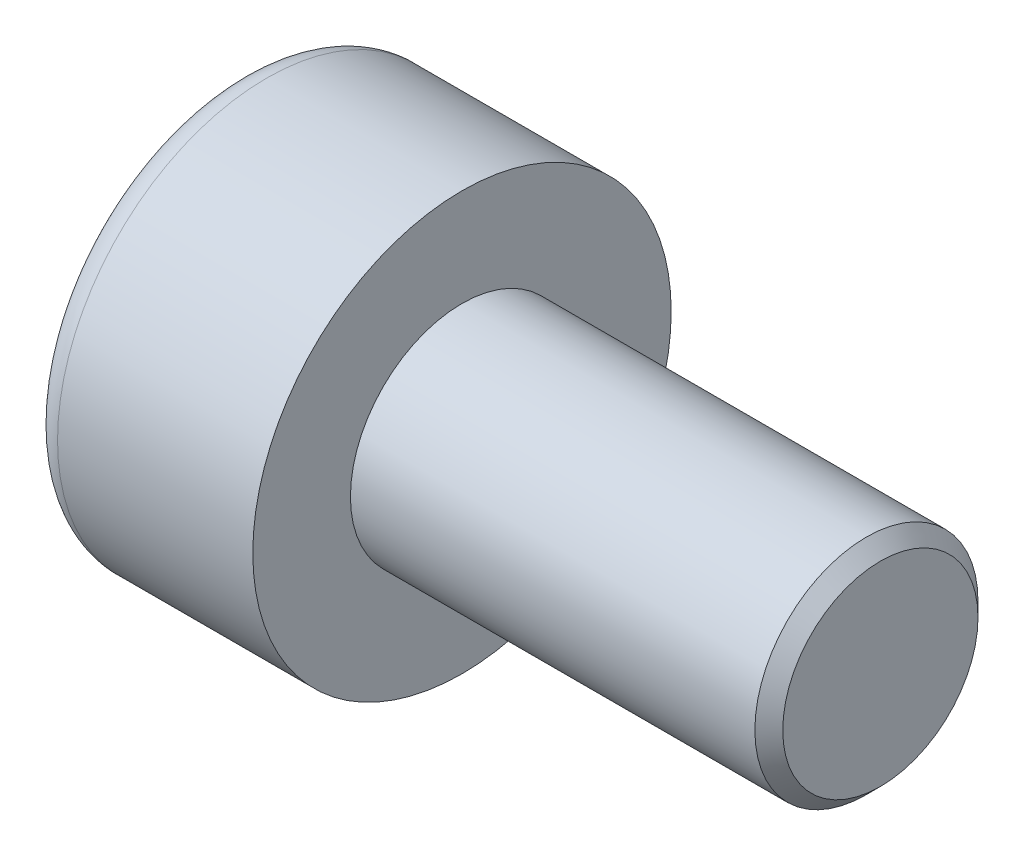
ISO-10303-21;
HEADER;
FILE_DESCRIPTION(('STEP AP214'),'2;1');
FILE_NAME('part.step','',(''),(''),'','','');
FILE_SCHEMA(('AUTOMOTIVE_DESIGN { 1 0 10303 214 1 1 1 1 }'));
ENDSEC;
DATA;
#1=APPLICATION_CONTEXT('core data for automotive mechanical design processes');
#2=APPLICATION_PROTOCOL_DEFINITION('international standard','automotive_design',2000,#1);
#3=PRODUCT_CONTEXT('',#1,'mechanical');
#4=PRODUCT('Part','Part','',(#3));
#5=PRODUCT_RELATED_PRODUCT_CATEGORY('part','',(#4));
#6=PRODUCT_DEFINITION_FORMATION('','',#4);
#7=PRODUCT_DEFINITION_CONTEXT('part definition',#1,'design');
#8=PRODUCT_DEFINITION('design','',#6,#7);
#9=PRODUCT_DEFINITION_SHAPE('','',#8);
#10=(LENGTH_UNIT() NAMED_UNIT(*) SI_UNIT(.MILLI.,.METRE.));
#11=(NAMED_UNIT(*) PLANE_ANGLE_UNIT() SI_UNIT($,.RADIAN.));
#12=(NAMED_UNIT(*) SI_UNIT($,.STERADIAN.) SOLID_ANGLE_UNIT());
#13=UNCERTAINTY_MEASURE_WITH_UNIT(LENGTH_MEASURE(1.E-05),#10,'distance_accuracy_value','');
#14=(GEOMETRIC_REPRESENTATION_CONTEXT(3) GLOBAL_UNCERTAINTY_ASSIGNED_CONTEXT((#13)) GLOBAL_UNIT_ASSIGNED_CONTEXT((#10,
#11,#12)) REPRESENTATION_CONTEXT('',''));
#15=CARTESIAN_POINT('',(0.,0.,0.));
#16=DIRECTION('',(0.,0.,1.));
#17=DIRECTION('',(1.,0.,0.));
#18=AXIS2_PLACEMENT_3D('',#15,#16,#17);
#19=CARTESIAN_POINT('',(0.699999999937972,0.,0.));
#20=DIRECTION('',(-1.,0.,0.));
#21=DIRECTION('',(0.,0.,1.));
#22=AXIS2_PLACEMENT_3D('',#19,#20,#21);
#23=CONICAL_SURFACE('',#22,0.750000000039108,1.04719755120245);
#24=CARTESIAN_POINT('',(1.13301270187094,0.,1.13686837721616E-10));
#25=VERTEX_POINT('',#24);
#26=VERTEX_LOOP('',#25);
#27=FACE_BOUND('',#26,.T.);
#28=CARTESIAN_POINT('',(0.699999999937972,0.,0.));
#29=DIRECTION('',(-1.,0.,0.));
#30=DIRECTION('',(0.,0.,1.));
#31=AXIS2_PLACEMENT_3D('',#28,#29,#30);
#32=CIRCLE('',#31,0.750000000039108);
#33=CARTESIAN_POINT('',(0.699999999968986,-0.375000000009781,0.64951905285526));
#34=VERTEX_POINT('',#33);
#35=CARTESIAN_POINT('',(0.699999999968986,0.37500000000977,0.649519052855266));
#36=VERTEX_POINT('',#35);
#37=EDGE_CURVE('E88',#34,#36,#32,.T.);
#38=ORIENTED_EDGE('',*,*,#37,.T.);
#39=CARTESIAN_POINT('',(0.699999999937972,0.,0.));
#40=DIRECTION('',(-1.,0.,0.));
#41=DIRECTION('',(0.,0.,1.));
#42=AXIS2_PLACEMENT_3D('',#39,#40,#41);
#43=CIRCLE('',#42,0.750000000039108);
#44=CARTESIAN_POINT('',(0.699999999968986,0.750000000019555,0.));
#45=VERTEX_POINT('',#44);
#46=EDGE_CURVE('E103',#36,#45,#43,.T.);
#47=ORIENTED_EDGE('',*,*,#46,.T.);
#48=CARTESIAN_POINT('',(0.699999999937972,0.,0.));
#49=DIRECTION('',(-1.,0.,0.));
#50=DIRECTION('',(0.,0.,1.));
#51=AXIS2_PLACEMENT_3D('',#48,#49,#50);
#52=CIRCLE('',#51,0.750000000039108);
#53=CARTESIAN_POINT('',(0.699999999968986,0.375000000009783,-0.64951905285526));
#54=VERTEX_POINT('',#53);
#55=EDGE_CURVE('E147',#45,#54,#52,.T.);
#56=ORIENTED_EDGE('',*,*,#55,.T.);
#57=CARTESIAN_POINT('',(0.699999999937972,0.,0.));
#58=DIRECTION('',(-1.,0.,0.));
#59=DIRECTION('',(0.,0.,1.));
#60=AXIS2_PLACEMENT_3D('',#57,#58,#59);
#61=CIRCLE('',#60,0.750000000039108);
#62=CARTESIAN_POINT('',(0.699999999968986,-0.375000000009786,-0.649519052855261));
#63=VERTEX_POINT('',#62);
#64=EDGE_CURVE('E135',#54,#63,#61,.T.);
#65=ORIENTED_EDGE('',*,*,#64,.T.);
#66=CARTESIAN_POINT('',(0.699999999937972,0.,0.));
#67=DIRECTION('',(-1.,0.,0.));
#68=DIRECTION('',(0.,0.,1.));
#69=AXIS2_PLACEMENT_3D('',#66,#67,#68);
#70=CIRCLE('',#69,0.750000000039108);
#71=CARTESIAN_POINT('',(0.699999999968986,-0.750000000019555,0.));
#72=VERTEX_POINT('',#71);
#73=EDGE_CURVE('E84',#63,#72,#70,.T.);
#74=ORIENTED_EDGE('',*,*,#73,.T.);
#75=CARTESIAN_POINT('',(0.699999999937972,0.,0.));
#76=DIRECTION('',(-1.,0.,0.));
#77=DIRECTION('',(0.,0.,1.));
#78=AXIS2_PLACEMENT_3D('',#75,#76,#77);
#79=CIRCLE('',#78,0.750000000039108);
#80=EDGE_CURVE('E86',#72,#34,#79,.T.);
#81=ORIENTED_EDGE('',*,*,#80,.T.);
#82=EDGE_LOOP('',(#38,#47,#56,#65,#74,#81));
#83=FACE_BOUND('',#82,.T.);
#84=ADVANCED_FACE('F17',(#27,#83),#23,.F.);
#85=CARTESIAN_POINT('',(0.7,0.,-0.866025403784446));
#86=DIRECTION('',(1.,0.,0.));
#87=DIRECTION('',(0.,0.,-1.));
#88=AXIS2_PLACEMENT_3D('',#85,#86,#87);
#89=PLANE('',#88);
#90=DIRECTION('',(0.,0.,1.));
#91=VECTOR('',#90,1.);
#92=CARTESIAN_POINT('',(0.7,-0.750000000000004,0.433012701892211));
#93=LINE('',#92,#91);
#94=CARTESIAN_POINT('',(0.7,-0.750000000000004,0.433012701892211));
#95=VERTEX_POINT('',#94);
#96=EDGE_CURVE('E109',#95,#72,#93,.F.);
#97=ORIENTED_EDGE('',*,*,#96,.F.);
#98=DIRECTION('',(0.,0.866025403784435,0.500000000000006));
#99=VECTOR('',#98,1.);
#100=CARTESIAN_POINT('',(0.7,0.,0.866025403784436));
#101=LINE('',#100,#99);
#102=EDGE_CURVE('E106',#34,#95,#101,.F.);
#103=ORIENTED_EDGE('',*,*,#102,.F.);
#104=ORIENTED_EDGE('',*,*,#80,.F.);
#105=EDGE_LOOP('',(#97,#103,#104));
#106=FACE_BOUND('',#105,.T.);
#107=ADVANCED_FACE('F107',(#106),#89,.F.);
#108=CARTESIAN_POINT('',(0.7,0.,-0.866025403784446));
#109=DIRECTION('',(1.,0.,0.));
#110=DIRECTION('',(0.,0.,-1.));
#111=AXIS2_PLACEMENT_3D('',#108,#109,#110);
#112=PLANE('',#111);
#113=DIRECTION('',(0.,0.866025403784435,0.500000000000006));
#114=VECTOR('',#113,1.);
#115=CARTESIAN_POINT('',(0.7,0.,0.866025403784436));
#116=LINE('',#115,#114);
#117=CARTESIAN_POINT('',(0.7,0.,0.866025403784436));
#118=VERTEX_POINT('',#117);
#119=EDGE_CURVE('E98',#118,#34,#116,.F.);
#120=ORIENTED_EDGE('',*,*,#119,.F.);
#121=DIRECTION('',(0.,0.866025403784444,-0.499999999999992));
#122=VECTOR('',#121,1.);
#123=CARTESIAN_POINT('',(0.7,0.749999999999999,0.433012701892223));
#124=LINE('',#123,#122);
#125=EDGE_CURVE('E101',#36,#118,#124,.F.);
#126=ORIENTED_EDGE('',*,*,#125,.F.);
#127=ORIENTED_EDGE('',*,*,#37,.F.);
#128=EDGE_LOOP('',(#120,#126,#127));
#129=FACE_BOUND('',#128,.T.);
#130=ADVANCED_FACE('F96',(#129),#112,.F.);
#131=CARTESIAN_POINT('',(0.7,0.,-0.866025403784446));
#132=DIRECTION('',(1.,0.,0.));
#133=DIRECTION('',(0.,0.,-1.));
#134=AXIS2_PLACEMENT_3D('',#131,#132,#133);
#135=PLANE('',#134);
#136=DIRECTION('',(0.,0.866025403784444,-0.499999999999992));
#137=VECTOR('',#136,1.);
#138=CARTESIAN_POINT('',(0.7,0.749999999999999,0.433012701892223));
#139=LINE('',#138,#137);
#140=CARTESIAN_POINT('',(0.7,0.75,0.433012701892223));
#141=VERTEX_POINT('',#140);
#142=EDGE_CURVE('E131',#141,#36,#139,.F.);
#143=ORIENTED_EDGE('',*,*,#142,.F.);
#144=DIRECTION('',(0.,0.,-1.));
#145=VECTOR('',#144,1.);
#146=CARTESIAN_POINT('',(0.7,0.750000000000006,-0.433012701892211));
#147=LINE('',#146,#145);
#148=EDGE_CURVE('E192',#45,#141,#147,.F.);
#149=ORIENTED_EDGE('',*,*,#148,.F.);
#150=ORIENTED_EDGE('',*,*,#46,.F.);
#151=EDGE_LOOP('',(#143,#149,#150));
#152=FACE_BOUND('',#151,.T.);
#153=ADVANCED_FACE('F401',(#152),#135,.F.);
#154=CARTESIAN_POINT('',(0.7,0.,-0.866025403784446));
#155=DIRECTION('',(1.,0.,0.));
#156=DIRECTION('',(0.,0.,-1.));
#157=AXIS2_PLACEMENT_3D('',#154,#155,#156);
#158=PLANE('',#157);
#159=DIRECTION('',(0.,0.,-1.));
#160=VECTOR('',#159,1.);
#161=CARTESIAN_POINT('',(0.7,0.750000000000006,-0.433012701892211));
#162=LINE('',#161,#160);
#163=CARTESIAN_POINT('',(0.7,0.750000000000006,-0.433012701892211));
#164=VERTEX_POINT('',#163);
#165=EDGE_CURVE('E189',#164,#45,#162,.F.);
#166=ORIENTED_EDGE('',*,*,#165,.F.);
#167=DIRECTION('',(0.,-0.866025403784434,-0.500000000000008));
#168=VECTOR('',#167,1.);
#169=CARTESIAN_POINT('',(0.7,0.,-0.866025403784446));
#170=LINE('',#169,#168);
#171=EDGE_CURVE('E177',#54,#164,#170,.F.);
#172=ORIENTED_EDGE('',*,*,#171,.F.);
#173=ORIENTED_EDGE('',*,*,#55,.F.);
#174=EDGE_LOOP('',(#166,#172,#173));
#175=FACE_BOUND('',#174,.T.);
#176=ADVANCED_FACE('F391',(#175),#158,.F.);
#177=CARTESIAN_POINT('',(0.7,0.,-0.866025403784446));
#178=DIRECTION('',(1.,0.,0.));
#179=DIRECTION('',(0.,0.,-1.));
#180=AXIS2_PLACEMENT_3D('',#177,#178,#179);
#181=PLANE('',#180);
#182=DIRECTION('',(0.,-0.866025403784433,0.50000000000001));
#183=VECTOR('',#182,1.);
#184=CARTESIAN_POINT('',(0.7,-0.75,-0.43301270189222));
#185=LINE('',#184,#183);
#186=CARTESIAN_POINT('',(0.7,-0.75,-0.43301270189222));
#187=VERTEX_POINT('',#186);
#188=EDGE_CURVE('E231',#187,#63,#185,.F.);
#189=ORIENTED_EDGE('',*,*,#188,.F.);
#190=DIRECTION('',(0.,0.,1.));
#191=VECTOR('',#190,1.);
#192=CARTESIAN_POINT('',(0.7,-0.750000000000004,0.433012701892211));
#193=LINE('',#192,#191);
#194=EDGE_CURVE('E119',#72,#187,#193,.F.);
#195=ORIENTED_EDGE('',*,*,#194,.F.);
#196=ORIENTED_EDGE('',*,*,#73,.F.);
#197=EDGE_LOOP('',(#189,#195,#196));
#198=FACE_BOUND('',#197,.T.);
#199=ADVANCED_FACE('F381',(#198),#181,.F.);
#200=CARTESIAN_POINT('',(0.7,0.,-0.866025403784446));
#201=DIRECTION('',(1.,0.,0.));
#202=DIRECTION('',(0.,0.,-1.));
#203=AXIS2_PLACEMENT_3D('',#200,#201,#202);
#204=PLANE('',#203);
#205=DIRECTION('',(0.,-0.866025403784434,-0.500000000000008));
#206=VECTOR('',#205,1.);
#207=CARTESIAN_POINT('',(0.7,0.,-0.866025403784446));
#208=LINE('',#207,#206);
#209=CARTESIAN_POINT('',(0.7,0.,-0.866025403784446));
#210=VERTEX_POINT('',#209);
#211=EDGE_CURVE('E181',#210,#54,#208,.F.);
#212=ORIENTED_EDGE('',*,*,#211,.F.);
#213=DIRECTION('',(0.,-0.866025403784433,0.50000000000001));
#214=VECTOR('',#213,1.);
#215=CARTESIAN_POINT('',(0.7,-0.75,-0.43301270189222));
#216=LINE('',#215,#214);
#217=EDGE_CURVE('E478',#63,#210,#216,.F.);
#218=ORIENTED_EDGE('',*,*,#217,.F.);
#219=ORIENTED_EDGE('',*,*,#64,.F.);
#220=EDGE_LOOP('',(#212,#218,#219));
#221=FACE_BOUND('',#220,.T.);
#222=ADVANCED_FACE('F371',(#221),#204,.F.);
#223=CARTESIAN_POINT('',(0.7,-0.750000000000004,0.433012701892211));
#224=DIRECTION('',(0.,1.,0.));
#225=DIRECTION('',(0.,0.,1.));
#226=AXIS2_PLACEMENT_3D('',#223,#224,#225);
#227=PLANE('',#226);
#228=ORIENTED_EDGE('',*,*,#194,.T.);
#229=DIRECTION('',(1.,0.,0.));
#230=VECTOR('',#229,1.);
#231=CARTESIAN_POINT('',(0.7,-0.75,-0.43301270189222));
#232=LINE('',#231,#230);
#233=CARTESIAN_POINT('',(0.,-0.75,-0.43301270189222));
#234=VERTEX_POINT('',#233);
#235=EDGE_CURVE('E186',#234,#187,#232,.T.);
#236=ORIENTED_EDGE('',*,*,#235,.F.);
#237=DIRECTION('',(0.,0.,-1.));
#238=VECTOR('',#237,1.);
#239=CARTESIAN_POINT('',(0.,-0.75,0.));
#240=LINE('',#239,#238);
#241=CARTESIAN_POINT('',(0.,-0.750000000000003,0.433012701892212));
#242=VERTEX_POINT('',#241);
#243=EDGE_CURVE('E170',#234,#242,#240,.F.);
#244=ORIENTED_EDGE('',*,*,#243,.T.);
#245=DIRECTION('',(1.,0.,0.));
#246=VECTOR('',#245,1.);
#247=CARTESIAN_POINT('',(0.7,-0.750000000000004,0.433012701892211));
#248=LINE('',#247,#246);
#249=EDGE_CURVE('E113',#95,#242,#248,.F.);
#250=ORIENTED_EDGE('',*,*,#249,.F.);
#251=ORIENTED_EDGE('',*,*,#96,.T.);
#252=EDGE_LOOP('',(#228,#236,#244,#250,#251));
#253=FACE_BOUND('',#252,.T.);
#254=ADVANCED_FACE('F362',(#253),#227,.T.);
#255=CARTESIAN_POINT('',(0.7,0.,0.866025403784436));
#256=DIRECTION('',(0.,0.500000000000006,-0.866025403784435));
#257=DIRECTION('',(0.,0.866025403784435,0.500000000000006));
#258=AXIS2_PLACEMENT_3D('',#255,#256,#257);
#259=PLANE('',#258);
#260=ORIENTED_EDGE('',*,*,#102,.T.);
#261=ORIENTED_EDGE('',*,*,#249,.T.);
#262=DIRECTION('',(0.,0.866025403784435,0.500000000000006));
#263=VECTOR('',#262,1.);
#264=CARTESIAN_POINT('',(0.,-0.750000000000004,0.433012701892211));
#265=LINE('',#264,#263);
#266=CARTESIAN_POINT('',(0.,0.,0.866025403784436));
#267=VERTEX_POINT('',#266);
#268=EDGE_CURVE('E173',#242,#267,#265,.T.);
#269=ORIENTED_EDGE('',*,*,#268,.T.);
#270=DIRECTION('',(1.,0.,0.));
#271=VECTOR('',#270,1.);
#272=CARTESIAN_POINT('',(0.7,0.,0.866025403784436));
#273=LINE('',#272,#271);
#274=EDGE_CURVE('E118',#118,#267,#273,.F.);
#275=ORIENTED_EDGE('',*,*,#274,.F.);
#276=ORIENTED_EDGE('',*,*,#119,.T.);
#277=EDGE_LOOP('',(#260,#261,#269,#275,#276));
#278=FACE_BOUND('',#277,.T.);
#279=ADVANCED_FACE('F115',(#278),#259,.T.);
#280=CARTESIAN_POINT('',(0.7,0.749999999999999,0.433012701892223));
#281=DIRECTION('',(0.,-0.499999999999992,-0.866025403784444));
#282=DIRECTION('',(0.,0.866025403784444,-0.499999999999992));
#283=AXIS2_PLACEMENT_3D('',#280,#281,#282);
#284=PLANE('',#283);
#285=ORIENTED_EDGE('',*,*,#125,.T.);
#286=ORIENTED_EDGE('',*,*,#274,.T.);
#287=DIRECTION('',(0.,0.866025403784443,-0.499999999999992));
#288=VECTOR('',#287,1.);
#289=CARTESIAN_POINT('',(0.,0.,0.866025403784436));
#290=LINE('',#289,#288);
#291=CARTESIAN_POINT('',(0.,0.749999999999999,0.433012701892223));
#292=VERTEX_POINT('',#291);
#293=EDGE_CURVE('E216',#267,#292,#290,.T.);
#294=ORIENTED_EDGE('',*,*,#293,.T.);
#295=DIRECTION('',(1.,0.,0.));
#296=VECTOR('',#295,1.);
#297=CARTESIAN_POINT('',(0.7,0.749999999999999,0.433012701892223));
#298=LINE('',#297,#296);
#299=EDGE_CURVE('E197',#141,#292,#298,.F.);
#300=ORIENTED_EDGE('',*,*,#299,.F.);
#301=ORIENTED_EDGE('',*,*,#142,.T.);
#302=EDGE_LOOP('',(#285,#286,#294,#300,#301));
#303=FACE_BOUND('',#302,.T.);
#304=ADVANCED_FACE('F213',(#303),#284,.T.);
#305=CARTESIAN_POINT('',(0.7,0.750000000000006,-0.433012701892211));
#306=DIRECTION('',(0.,-1.,0.));
#307=DIRECTION('',(0.,0.,-1.));
#308=AXIS2_PLACEMENT_3D('',#305,#306,#307);
#309=PLANE('',#308);
#310=ORIENTED_EDGE('',*,*,#148,.T.);
#311=ORIENTED_EDGE('',*,*,#299,.T.);
#312=DIRECTION('',(0.,0.,-1.));
#313=VECTOR('',#312,1.);
#314=CARTESIAN_POINT('',(0.,0.749999999999999,0.));
#315=LINE('',#314,#313);
#316=CARTESIAN_POINT('',(0.,0.750000000000004,-0.433012701892212));
#317=VERTEX_POINT('',#316);
#318=EDGE_CURVE('E163',#292,#317,#315,.T.);
#319=ORIENTED_EDGE('',*,*,#318,.T.);
#320=DIRECTION('',(1.,0.,0.));
#321=VECTOR('',#320,1.);
#322=CARTESIAN_POINT('',(0.7,0.750000000000006,-0.433012701892211));
#323=LINE('',#322,#321);
#324=EDGE_CURVE('E180',#164,#317,#323,.F.);
#325=ORIENTED_EDGE('',*,*,#324,.F.);
#326=ORIENTED_EDGE('',*,*,#165,.T.);
#327=EDGE_LOOP('',(#310,#311,#319,#325,#326));
#328=FACE_BOUND('',#327,.T.);
#329=ADVANCED_FACE('F335',(#328),#309,.T.);
#330=CARTESIAN_POINT('',(0.7,0.,-0.866025403784446));
#331=DIRECTION('',(0.,-0.500000000000008,0.866025403784434));
#332=DIRECTION('',(0.,-0.866025403784434,-0.500000000000008));
#333=AXIS2_PLACEMENT_3D('',#330,#331,#332);
#334=PLANE('',#333);
#335=ORIENTED_EDGE('',*,*,#171,.T.);
#336=ORIENTED_EDGE('',*,*,#324,.T.);
#337=DIRECTION('',(0.,-0.866025403784434,-0.500000000000008));
#338=VECTOR('',#337,1.);
#339=CARTESIAN_POINT('',(0.,0.750000000000006,-0.433012701892211));
#340=LINE('',#339,#338);
#341=CARTESIAN_POINT('',(0.,0.,-0.866025403784446));
#342=VERTEX_POINT('',#341);
#343=EDGE_CURVE('E155',#317,#342,#340,.T.);
#344=ORIENTED_EDGE('',*,*,#343,.T.);
#345=DIRECTION('',(1.,0.,0.));
#346=VECTOR('',#345,1.);
#347=CARTESIAN_POINT('',(0.7,0.,-0.866025403784446));
#348=LINE('',#347,#346);
#349=EDGE_CURVE('E174',#210,#342,#348,.F.);
#350=ORIENTED_EDGE('',*,*,#349,.F.);
#351=ORIENTED_EDGE('',*,*,#211,.T.);
#352=EDGE_LOOP('',(#335,#336,#344,#350,#351));
#353=FACE_BOUND('',#352,.T.);
#354=ADVANCED_FACE('F275',(#353),#334,.T.);
#355=CARTESIAN_POINT('',(0.7,-0.75,-0.43301270189222));
#356=DIRECTION('',(0.,0.50000000000001,0.866025403784433));
#357=DIRECTION('',(0.,-0.866025403784433,0.50000000000001));
#358=AXIS2_PLACEMENT_3D('',#355,#356,#357);
#359=PLANE('',#358);
#360=ORIENTED_EDGE('',*,*,#217,.T.);
#361=ORIENTED_EDGE('',*,*,#349,.T.);
#362=DIRECTION('',(0.,-0.866025403784433,0.50000000000001));
#363=VECTOR('',#362,1.);
#364=CARTESIAN_POINT('',(0.,0.,-0.866025403784446));
#365=LINE('',#364,#363);
#366=EDGE_CURVE('E153',#342,#234,#365,.T.);
#367=ORIENTED_EDGE('',*,*,#366,.T.);
#368=ORIENTED_EDGE('',*,*,#235,.T.);
#369=ORIENTED_EDGE('',*,*,#188,.T.);
#370=EDGE_LOOP('',(#360,#361,#367,#368,#369));
#371=FACE_BOUND('',#370,.T.);
#372=ADVANCED_FACE('F270',(#371),#359,.T.);
#373=CARTESIAN_POINT('',(0.,0.,0.));
#374=DIRECTION('',(1.,0.,0.));
#375=DIRECTION('',(0.,0.,-1.));
#376=AXIS2_PLACEMENT_3D('',#373,#374,#375);
#377=PLANE('',#376);
#378=ORIENTED_EDGE('',*,*,#343,.F.);
#379=ORIENTED_EDGE('',*,*,#318,.F.);
#380=ORIENTED_EDGE('',*,*,#293,.F.);
#381=ORIENTED_EDGE('',*,*,#268,.F.);
#382=ORIENTED_EDGE('',*,*,#243,.F.);
#383=ORIENTED_EDGE('',*,*,#366,.F.);
#384=EDGE_LOOP('',(#378,#379,#380,#381,#382,#383));
#385=FACE_BOUND('',#384,.T.);
#386=CARTESIAN_POINT('',(0.,0.,0.));
#387=DIRECTION('',(1.,0.,0.));
#388=DIRECTION('',(0.,0.,-1.));
#389=AXIS2_PLACEMENT_3D('',#386,#387,#388);
#390=CIRCLE('',#389,1.3);
#391=CARTESIAN_POINT('',(0.,0.,-1.3));
#392=VERTEX_POINT('',#391);
#393=CARTESIAN_POINT('',(0.,0.,1.3));
#394=VERTEX_POINT('',#393);
#395=EDGE_CURVE('E151',#392,#394,#390,.T.);
#396=ORIENTED_EDGE('',*,*,#395,.F.);
#397=CARTESIAN_POINT('',(0.,0.,0.));
#398=DIRECTION('',(1.,0.,0.));
#399=DIRECTION('',(0.,0.,1.));
#400=AXIS2_PLACEMENT_3D('',#397,#398,#399);
#401=CIRCLE('',#400,1.3);
#402=EDGE_CURVE('E36',#394,#392,#401,.T.);
#403=ORIENTED_EDGE('',*,*,#402,.F.);
#404=EDGE_LOOP('',(#396,#403));
#405=FACE_BOUND('',#404,.T.);
#406=ADVANCED_FACE('F222',(#385,#405),#377,.F.);
#407=CARTESIAN_POINT('',(0.2,0.,0.));
#408=DIRECTION('',(1.,0.,0.));
#409=DIRECTION('',(0.,0.,-1.));
#410=AXIS2_PLACEMENT_3D('',#407,#408,#409);
#411=TOROIDAL_SURFACE('',#410,1.3,0.2);
#412=CARTESIAN_POINT('',(0.2,0.,0.));
#413=DIRECTION('',(-1.,0.,0.));
#414=DIRECTION('',(0.,0.,1.));
#415=AXIS2_PLACEMENT_3D('',#412,#413,#414);
#416=CIRCLE('',#415,1.5);
#417=CARTESIAN_POINT('',(0.2,0.,1.5));
#418=VERTEX_POINT('',#417);
#419=EDGE_CURVE('E144',#418,#418,#416,.F.);
#420=ORIENTED_EDGE('',*,*,#419,.F.);
#421=EDGE_LOOP('',(#420));
#422=FACE_BOUND('',#421,.T.);
#423=ORIENTED_EDGE('',*,*,#395,.T.);
#424=ORIENTED_EDGE('',*,*,#402,.T.);
#425=EDGE_LOOP('',(#423,#424));
#426=FACE_BOUND('',#425,.T.);
#427=ADVANCED_FACE('F150',(#422,#426),#411,.T.);
#428=CARTESIAN_POINT('',(4.6,0.,0.));
#429=DIRECTION('',(1.,0.,0.));
#430=DIRECTION('',(0.,0.,-1.));
#431=AXIS2_PLACEMENT_3D('',#428,#429,#430);
#432=PLANE('',#431);
#433=CARTESIAN_POINT('',(4.60000000003902,0.,0.));
#434=DIRECTION('',(-1.,0.,0.));
#435=DIRECTION('',(0.,0.,1.));
#436=AXIS2_PLACEMENT_3D('',#433,#434,#435);
#437=CIRCLE('',#436,0.699999999994816);
#438=CARTESIAN_POINT('',(4.60000000003902,0.,0.699999999994816));
#439=VERTEX_POINT('',#438);
#440=EDGE_CURVE('E141',#439,#439,#437,.T.);
#441=ORIENTED_EDGE('',*,*,#440,.F.);
#442=EDGE_LOOP('',(#441));
#443=FACE_BOUND('',#442,.T.);
#444=ADVANCED_FACE('F243',(#443),#432,.T.);
#445=CARTESIAN_POINT('',(1.6,0.,0.));
#446=DIRECTION('',(-1.,0.,0.));
#447=DIRECTION('',(0.,0.,1.));
#448=AXIS2_PLACEMENT_3D('',#445,#446,#447);
#449=CYLINDRICAL_SURFACE('',#448,1.5);
#450=ORIENTED_EDGE('',*,*,#419,.T.);
#451=EDGE_LOOP('',(#450));
#452=FACE_BOUND('',#451,.T.);
#453=CARTESIAN_POINT('',(1.6,0.,0.));
#454=DIRECTION('',(-1.,0.,0.));
#455=DIRECTION('',(0.,0.,1.));
#456=AXIS2_PLACEMENT_3D('',#453,#454,#455);
#457=CIRCLE('',#456,1.5);
#458=CARTESIAN_POINT('',(1.6,0.,1.5));
#459=VERTEX_POINT('',#458);
#460=EDGE_CURVE('E138',#459,#459,#457,.F.);
#461=ORIENTED_EDGE('',*,*,#460,.F.);
#462=EDGE_LOOP('',(#461));
#463=FACE_BOUND('',#462,.T.);
#464=ADVANCED_FACE('F290',(#452,#463),#449,.T.);
#465=CARTESIAN_POINT('',(4.50000000000728,0.,0.));
#466=DIRECTION('',(-1.,0.,0.));
#467=DIRECTION('',(0.,0.,1.));
#468=AXIS2_PLACEMENT_3D('',#465,#466,#467);
#469=CONICAL_SURFACE('',#468,0.800000000026557,0.785398163397448);
#470=CARTESIAN_POINT('',(4.5,0.,0.));
#471=DIRECTION('',(-1.,0.,0.));
#472=DIRECTION('',(0.,0.,1.));
#473=AXIS2_PLACEMENT_3D('',#470,#471,#472);
#474=CIRCLE('',#473,0.8);
#475=CARTESIAN_POINT('',(4.5,0.,0.8));
#476=VERTEX_POINT('',#475);
#477=EDGE_CURVE('E28',#476,#476,#474,.T.);
#478=ORIENTED_EDGE('',*,*,#477,.F.);
#479=EDGE_LOOP('',(#478));
#480=FACE_BOUND('',#479,.T.);
#481=ORIENTED_EDGE('',*,*,#440,.T.);
#482=EDGE_LOOP('',(#481));
#483=FACE_BOUND('',#482,.T.);
#484=ADVANCED_FACE('F284',(#480,#483),#469,.T.);
#485=CARTESIAN_POINT('',(1.6,0.,0.));
#486=DIRECTION('',(1.,0.,0.));
#487=DIRECTION('',(0.,0.,-1.));
#488=AXIS2_PLACEMENT_3D('',#485,#486,#487);
#489=PLANE('',#488);
#490=CARTESIAN_POINT('',(1.6,0.,0.));
#491=DIRECTION('',(-1.,0.,0.));
#492=DIRECTION('',(0.,0.,1.));
#493=AXIS2_PLACEMENT_3D('',#490,#491,#492);
#494=CIRCLE('',#493,0.8);
#495=CARTESIAN_POINT('',(1.6,0.,0.8));
#496=VERTEX_POINT('',#495);
#497=EDGE_CURVE('E11',#496,#496,#494,.F.);
#498=ORIENTED_EDGE('',*,*,#497,.F.);
#499=EDGE_LOOP('',(#498));
#500=FACE_BOUND('',#499,.T.);
#501=ORIENTED_EDGE('',*,*,#460,.T.);
#502=EDGE_LOOP('',(#501));
#503=FACE_BOUND('',#502,.T.);
#504=ADVANCED_FACE('F278',(#500,#503),#489,.T.);
#505=CARTESIAN_POINT('',(4.6,0.,0.));
#506=DIRECTION('',(-1.,0.,0.));
#507=DIRECTION('',(0.,0.,1.));
#508=AXIS2_PLACEMENT_3D('',#505,#506,#507);
#509=CYLINDRICAL_SURFACE('',#508,0.8);
#510=ORIENTED_EDGE('',*,*,#497,.T.);
#511=EDGE_LOOP('',(#510));
#512=FACE_BOUND('',#511,.T.);
#513=ORIENTED_EDGE('',*,*,#477,.T.);
#514=EDGE_LOOP('',(#513));
#515=FACE_BOUND('',#514,.T.);
#516=ADVANCED_FACE('F276',(#512,#515),#509,.T.);
#517=CLOSED_SHELL('',(#84,#107,#130,#153,#176,#199,#222,#254,#279,#304,#329,#354,#372,#406,#427,
#444,#464,#484,#504,#516));
#518=MANIFOLD_SOLID_BREP('B1',#517);
#519=ADVANCED_BREP_SHAPE_REPRESENTATION('',(#18,#518),#14);
#520=SHAPE_DEFINITION_REPRESENTATION(#9,#519);
ENDSEC;
END-ISO-10303-21;
